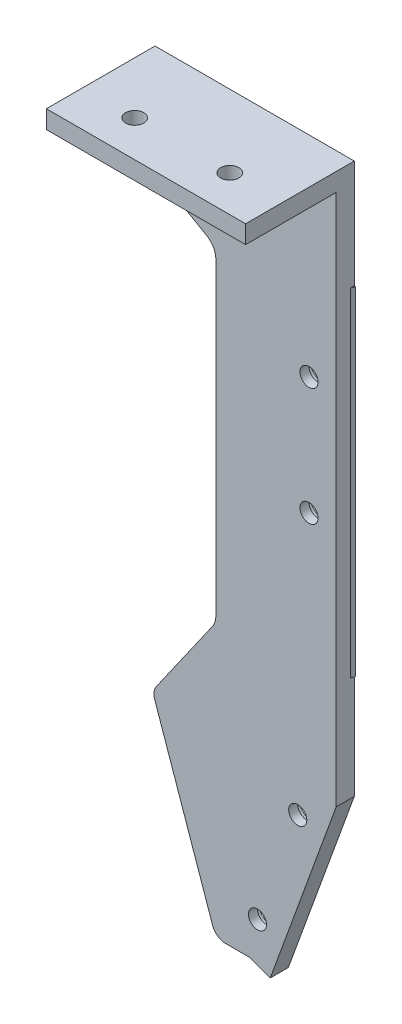
ISO-10303-21;
HEADER;
FILE_DESCRIPTION(('STEP AP214'),'2;1');
FILE_NAME('part.step','',(''),(''),'','','');
FILE_SCHEMA(('AUTOMOTIVE_DESIGN { 1 0 10303 214 1 1 1 1 }'));
ENDSEC;
DATA;
#1=APPLICATION_CONTEXT('core data for automotive mechanical design processes');
#2=APPLICATION_PROTOCOL_DEFINITION('international standard','automotive_design',2000,#1);
#3=PRODUCT_CONTEXT('',#1,'mechanical');
#4=PRODUCT('Part','Part','',(#3));
#5=PRODUCT_RELATED_PRODUCT_CATEGORY('part','',(#4));
#6=PRODUCT_DEFINITION_FORMATION('','',#4);
#7=PRODUCT_DEFINITION_CONTEXT('part definition',#1,'design');
#8=PRODUCT_DEFINITION('design','',#6,#7);
#9=PRODUCT_DEFINITION_SHAPE('','',#8);
#10=(LENGTH_UNIT() NAMED_UNIT(*) SI_UNIT(.MILLI.,.METRE.));
#11=(NAMED_UNIT(*) PLANE_ANGLE_UNIT() SI_UNIT($,.RADIAN.));
#12=(NAMED_UNIT(*) SI_UNIT($,.STERADIAN.) SOLID_ANGLE_UNIT());
#13=UNCERTAINTY_MEASURE_WITH_UNIT(LENGTH_MEASURE(1.E-05),#10,'distance_accuracy_value','');
#14=(GEOMETRIC_REPRESENTATION_CONTEXT(3) GLOBAL_UNCERTAINTY_ASSIGNED_CONTEXT((#13)) GLOBAL_UNIT_ASSIGNED_CONTEXT((#10,
#11,#12)) REPRESENTATION_CONTEXT('',''));
#15=CARTESIAN_POINT('',(0.,0.,0.));
#16=DIRECTION('',(0.,0.,1.));
#17=DIRECTION('',(1.,0.,0.));
#18=AXIS2_PLACEMENT_3D('',#15,#16,#17);
#19=CARTESIAN_POINT('',(92.2895532458189,-51.5135083268963,13.5));
#20=DIRECTION('',(0.,0.,1.));
#21=DIRECTION('',(1.,0.,0.));
#22=AXIS2_PLACEMENT_3D('',#19,#20,#21);
#23=CYLINDRICAL_SURFACE('',#22,0.999999999999998);
#24=CARTESIAN_POINT('',(92.2895532458189,-51.5135083268963,23.5));
#25=DIRECTION('',(0.,0.,1.));
#26=DIRECTION('',(1.,0.,0.));
#27=AXIS2_PLACEMENT_3D('',#24,#25,#26);
#28=CIRCLE('',#27,0.999999999999998);
#29=CARTESIAN_POINT('',(93.2895532458189,-51.5135083268963,23.5));
#30=VERTEX_POINT('',#29);
#31=EDGE_CURVE('E360',#30,#30,#28,.T.);
#32=ORIENTED_EDGE('',*,*,#31,.T.);
#33=EDGE_LOOP('',(#32));
#34=FACE_BOUND('',#33,.T.);
#35=CARTESIAN_POINT('',(92.2895532458189,-51.5135083268963,22.5));
#36=DIRECTION('',(0.,0.,-1.));
#37=DIRECTION('',(-1.,0.,0.));
#38=AXIS2_PLACEMENT_3D('',#35,#36,#37);
#39=CIRCLE('',#38,0.999999999999998);
#40=CARTESIAN_POINT('',(91.2895532458189,-51.5135083268963,22.5));
#41=VERTEX_POINT('',#40);
#42=EDGE_CURVE('E40',#41,#41,#39,.F.);
#43=ORIENTED_EDGE('',*,*,#42,.F.);
#44=EDGE_LOOP('',(#43));
#45=FACE_BOUND('',#44,.T.);
#46=ADVANCED_FACE('F36',(#34,#45),#23,.F.);
#47=CARTESIAN_POINT('',(91.0464555518717,-94.0197311334143,13.5));
#48=DIRECTION('',(0.,0.,1.));
#49=DIRECTION('',(1.,0.,0.));
#50=AXIS2_PLACEMENT_3D('',#47,#48,#49);
#51=CYLINDRICAL_SURFACE('',#50,0.999999999999998);
#52=CARTESIAN_POINT('',(91.0464555518717,-94.0197311334143,23.5));
#53=DIRECTION('',(0.,0.,1.));
#54=DIRECTION('',(1.,0.,0.));
#55=AXIS2_PLACEMENT_3D('',#52,#53,#54);
#56=CIRCLE('',#55,0.999999999999998);
#57=CARTESIAN_POINT('',(92.0464555518717,-94.0197311334143,23.5));
#58=VERTEX_POINT('',#57);
#59=EDGE_CURVE('E336',#58,#58,#56,.T.);
#60=ORIENTED_EDGE('',*,*,#59,.T.);
#61=EDGE_LOOP('',(#60));
#62=FACE_BOUND('',#61,.T.);
#63=CARTESIAN_POINT('',(91.0464555518717,-94.0197311334143,22.5));
#64=DIRECTION('',(0.,0.,-1.));
#65=DIRECTION('',(-1.,0.,0.));
#66=AXIS2_PLACEMENT_3D('',#63,#64,#65);
#67=CIRCLE('',#66,0.999999999999998);
#68=CARTESIAN_POINT('',(90.0464555518717,-94.0197311334143,22.5));
#69=VERTEX_POINT('',#68);
#70=EDGE_CURVE('E340',#69,#69,#67,.F.);
#71=ORIENTED_EDGE('',*,*,#70,.F.);
#72=EDGE_LOOP('',(#71));
#73=FACE_BOUND('',#72,.T.);
#74=ADVANCED_FACE('F460',(#62,#73),#51,.F.);
#75=CARTESIAN_POINT('',(92.2895532458189,-64.5135083268963,13.5));
#76=DIRECTION('',(0.,0.,1.));
#77=DIRECTION('',(1.,0.,0.));
#78=AXIS2_PLACEMENT_3D('',#75,#76,#77);
#79=CYLINDRICAL_SURFACE('',#78,0.999999999999998);
#80=CARTESIAN_POINT('',(92.2895532458189,-64.5135083268963,23.5));
#81=DIRECTION('',(0.,0.,1.));
#82=DIRECTION('',(1.,0.,0.));
#83=AXIS2_PLACEMENT_3D('',#80,#81,#82);
#84=CIRCLE('',#83,0.999999999999998);
#85=CARTESIAN_POINT('',(93.2895532458189,-64.5135083268963,23.5));
#86=VERTEX_POINT('',#85);
#87=EDGE_CURVE('E357',#86,#86,#84,.T.);
#88=ORIENTED_EDGE('',*,*,#87,.T.);
#89=EDGE_LOOP('',(#88));
#90=FACE_BOUND('',#89,.T.);
#91=CARTESIAN_POINT('',(92.2895532458189,-64.5135083268963,22.5));
#92=DIRECTION('',(0.,0.,-1.));
#93=DIRECTION('',(-1.,0.,0.));
#94=AXIS2_PLACEMENT_3D('',#91,#92,#93);
#95=CIRCLE('',#94,0.999999999999998);
#96=CARTESIAN_POINT('',(91.2895532458189,-64.5135083268963,22.5));
#97=VERTEX_POINT('',#96);
#98=EDGE_CURVE('E338',#97,#97,#95,.F.);
#99=ORIENTED_EDGE('',*,*,#98,.F.);
#100=EDGE_LOOP('',(#99));
#101=FACE_BOUND('',#100,.T.);
#102=ADVANCED_FACE('F466',(#90,#101),#79,.F.);
#103=CARTESIAN_POINT('',(86.6001936886376,-106.235735203631,13.5));
#104=DIRECTION('',(0.,0.,1.));
#105=DIRECTION('',(1.,0.,0.));
#106=AXIS2_PLACEMENT_3D('',#103,#104,#105);
#107=CYLINDRICAL_SURFACE('',#106,0.999999999999998);
#108=CARTESIAN_POINT('',(86.6001936886376,-106.235735203631,23.5));
#109=DIRECTION('',(0.,0.,1.));
#110=DIRECTION('',(1.,0.,0.));
#111=AXIS2_PLACEMENT_3D('',#108,#109,#110);
#112=CIRCLE('',#111,0.999999999999998);
#113=CARTESIAN_POINT('',(87.6001936886376,-106.235735203631,23.5));
#114=VERTEX_POINT('',#113);
#115=EDGE_CURVE('E361',#114,#114,#112,.T.);
#116=ORIENTED_EDGE('',*,*,#115,.T.);
#117=EDGE_LOOP('',(#116));
#118=FACE_BOUND('',#117,.T.);
#119=CARTESIAN_POINT('',(86.6001936886376,-106.235735203631,22.5));
#120=DIRECTION('',(0.,0.,-1.));
#121=DIRECTION('',(-1.,0.,0.));
#122=AXIS2_PLACEMENT_3D('',#119,#120,#121);
#123=CIRCLE('',#122,0.999999999999998);
#124=CARTESIAN_POINT('',(85.6001936886376,-106.235735203631,22.5));
#125=VERTEX_POINT('',#124);
#126=EDGE_CURVE('E333',#125,#125,#123,.F.);
#127=ORIENTED_EDGE('',*,*,#126,.F.);
#128=EDGE_LOOP('',(#127));
#129=FACE_BOUND('',#128,.T.);
#130=ADVANCED_FACE('F490',(#118,#129),#107,.F.);
#131=CARTESIAN_POINT('',(0.,0.,23.5));
#132=DIRECTION('',(0.,0.,-1.));
#133=DIRECTION('',(-1.,0.,0.));
#134=AXIS2_PLACEMENT_3D('',#131,#132,#133);
#135=PLANE('',#134);
#136=ORIENTED_EDGE('',*,*,#87,.F.);
#137=EDGE_LOOP('',(#136));
#138=FACE_BOUND('',#137,.T.);
#139=ORIENTED_EDGE('',*,*,#115,.F.);
#140=EDGE_LOOP('',(#139));
#141=FACE_BOUND('',#140,.T.);
#142=ORIENTED_EDGE('',*,*,#59,.F.);
#143=EDGE_LOOP('',(#142));
#144=FACE_BOUND('',#143,.T.);
#145=ORIENTED_EDGE('',*,*,#31,.F.);
#146=EDGE_LOOP('',(#145));
#147=FACE_BOUND('',#146,.T.);
#148=DIRECTION('',(1.,0.,0.));
#149=VECTOR('',#148,1.);
#150=CARTESIAN_POINT('',(95.2895532458189,-32.3635083268963,23.5));
#151=LINE('',#150,#149);
#152=CARTESIAN_POINT('',(73.2895532458189,-32.3635083268963,23.5));
#153=VERTEX_POINT('',#152);
#154=CARTESIAN_POINT('',(95.2895532458189,-32.3635083268963,23.5));
#155=VERTEX_POINT('',#154);
#156=EDGE_CURVE('E53',#153,#155,#151,.T.);
#157=ORIENTED_EDGE('',*,*,#156,.F.);
#158=DIRECTION('',(0.,-1.,0.));
#159=VECTOR('',#158,1.);
#160=CARTESIAN_POINT('',(73.2895532458189,0.,23.5));
#161=LINE('',#160,#159);
#162=CARTESIAN_POINT('',(73.2895532458189,-38.0445239136101,23.5));
#163=VERTEX_POINT('',#162);
#164=EDGE_CURVE('E56',#153,#163,#161,.T.);
#165=ORIENTED_EDGE('',*,*,#164,.T.);
#166=CARTESIAN_POINT('',(75.2895532458189,-38.0445239136101,23.5));
#167=DIRECTION('',(0.,0.,-1.));
#168=DIRECTION('',(-1.,0.,0.));
#169=AXIS2_PLACEMENT_3D('',#166,#167,#168);
#170=CIRCLE('',#169,2.);
#171=CARTESIAN_POINT('',(74.2895532458182,-39.7765747211803,23.5));
#172=VERTEX_POINT('',#171);
#173=EDGE_CURVE('E11',#163,#172,#170,.F.);
#174=ORIENTED_EDGE('',*,*,#173,.T.);
#175=DIRECTION('',(-0.866025403784429,0.500000000000017,0.));
#176=VECTOR('',#175,1.);
#177=CARTESIAN_POINT('',(1.34862621941938,2.3358891324538,23.5));
#178=LINE('',#177,#176);
#179=CARTESIAN_POINT('',(81.,-43.65085296109,23.5));
#180=VERTEX_POINT('',#179);
#181=EDGE_CURVE('E236',#180,#172,#178,.T.);
#182=ORIENTED_EDGE('',*,*,#181,.F.);
#183=CARTESIAN_POINT('',(80.,-45.38290376865,23.5));
#184=DIRECTION('',(0.,0.,-1.));
#185=DIRECTION('',(-1.,0.,0.));
#186=AXIS2_PLACEMENT_3D('',#183,#184,#185);
#187=CIRCLE('',#186,2.);
#188=CARTESIAN_POINT('',(82.,-45.38290376865,23.5));
#189=VERTEX_POINT('',#188);
#190=EDGE_CURVE('E233',#189,#180,#187,.F.);
#191=ORIENTED_EDGE('',*,*,#190,.F.);
#192=DIRECTION('',(0.,1.,0.));
#193=VECTOR('',#192,1.);
#194=CARTESIAN_POINT('',(82.,0.,23.5));
#195=LINE('',#194,#193);
#196=CARTESIAN_POINT('',(82.,-79.5316263413399,23.5));
#197=VERTEX_POINT('',#196);
#198=EDGE_CURVE('E230',#197,#189,#195,.T.);
#199=ORIENTED_EDGE('',*,*,#198,.F.);
#200=CARTESIAN_POINT('',(80.,-79.5316263413399,23.5));
#201=DIRECTION('',(0.,0.,-1.));
#202=DIRECTION('',(-1.,0.,0.));
#203=AXIS2_PLACEMENT_3D('',#200,#201,#202);
#204=CIRCLE('',#203,2.);
#205=CARTESIAN_POINT('',(81.6383040885789,-80.6787792140407,23.5));
#206=VERTEX_POINT('',#205);
#207=EDGE_CURVE('E227',#206,#197,#204,.F.);
#208=ORIENTED_EDGE('',*,*,#207,.F.);
#209=DIRECTION('',(0.573576436351011,0.819152044289016,0.));
#210=VECTOR('',#209,1.);
#211=CARTESIAN_POINT('',(92.6867510176329,-64.8999617547072,23.5));
#212=LINE('',#211,#210);
#213=CARTESIAN_POINT('',(75.439940364479,-89.5309600116699,23.5));
#214=VERTEX_POINT('',#213);
#215=EDGE_CURVE('E224',#214,#206,#212,.T.);
#216=ORIENTED_EDGE('',*,*,#215,.F.);
#217=CARTESIAN_POINT('',(76.668668430912,-90.3913246662,23.5));
#218=DIRECTION('',(0.,0.,-1.));
#219=DIRECTION('',(-1.,0.,0.));
#220=AXIS2_PLACEMENT_3D('',#217,#218,#219);
#221=CIRCLE('',#220,1.5);
#222=CARTESIAN_POINT('',(75.2518037731161,-90.8837620139803,23.5));
#223=VERTEX_POINT('',#222);
#224=EDGE_CURVE('E221',#223,#214,#221,.T.);
#225=ORIENTED_EDGE('',*,*,#224,.F.);
#226=DIRECTION('',(-0.328291565188003,0.944576438530208,0.));
#227=VECTOR('',#226,1.);
#228=CARTESIAN_POINT('',(38.9587796924058,13.5402898498463,23.5));
#229=LINE('',#228,#227);
#230=CARTESIAN_POINT('',(81.6498173079181,-109.29243734778,23.5));
#231=VERTEX_POINT('',#230);
#232=EDGE_CURVE('E218',#231,#223,#229,.T.);
#233=ORIENTED_EDGE('',*,*,#232,.F.);
#234=CARTESIAN_POINT('',(83.066681965713,-108.8,23.5));
#235=DIRECTION('',(0.,0.,-1.));
#236=DIRECTION('',(-1.,0.,0.));
#237=AXIS2_PLACEMENT_3D('',#234,#235,#236);
#238=CIRCLE('',#237,1.5);
#239=CARTESIAN_POINT('',(83.066681965713,-110.3,23.5));
#240=VERTEX_POINT('',#239);
#241=EDGE_CURVE('E215',#240,#231,#238,.T.);
#242=ORIENTED_EDGE('',*,*,#241,.F.);
#243=DIRECTION('',(-1.,0.,0.));
#244=VECTOR('',#243,1.);
#245=CARTESIAN_POINT('',(-1.77186336060973E-12,-110.299999999999,23.5));
#246=LINE('',#245,#244);
#247=CARTESIAN_POINT('',(85.720595314676,-110.3,23.5));
#248=VERTEX_POINT('',#247);
#249=EDGE_CURVE('E212',#248,#240,#246,.T.);
#250=ORIENTED_EDGE('',*,*,#249,.F.);
#251=DIRECTION('',(-0.939692620785897,0.342020143325699,0.));
#252=VECTOR('',#251,1.);
#253=CARTESIAN_POINT('',(-25.4223318677038,-69.8472827563908,23.5));
#254=LINE('',#253,#252);
#255=CARTESIAN_POINT('',(88.0101485604946,-111.133329231243,23.5));
#256=VERTEX_POINT('',#255);
#257=EDGE_CURVE('E209',#256,#248,#254,.T.);
#258=ORIENTED_EDGE('',*,*,#257,.F.);
#259=DIRECTION('',(-0.342020143325699,-0.939692620785897,0.));
#260=VECTOR('',#259,1.);
#261=CARTESIAN_POINT('',(113.432480428198,-41.2860464748519,23.5));
#262=LINE('',#261,#260);
#263=CARTESIAN_POINT('',(95.2895532458189,-91.1333292312439,23.5));
#264=VERTEX_POINT('',#263);
#265=EDGE_CURVE('E205',#264,#256,#262,.T.);
#266=ORIENTED_EDGE('',*,*,#265,.F.);
#267=DIRECTION('',(0.,1.,0.));
#268=VECTOR('',#267,1.);
#269=CARTESIAN_POINT('',(95.2895532458189,0.,23.5));
#270=LINE('',#269,#268);
#271=EDGE_CURVE('E203',#264,#155,#270,.T.);
#272=ORIENTED_EDGE('',*,*,#271,.T.);
#273=EDGE_LOOP('',(#157,#165,#174,#182,#191,#199,#208,#216,#225,#233,#242,#250,#258,#266,#272));
#274=FACE_BOUND('',#273,.T.);
#275=ADVANCED_FACE('F401',(#138,#141,#144,#147,#274),#135,.F.);
#276=CARTESIAN_POINT('',(93.5,-42.3,21.));
#277=DIRECTION('',(0.,-1.,0.));
#278=DIRECTION('',(-1.,0.,0.));
#279=AXIS2_PLACEMENT_3D('',#276,#277,#278);
#280=CYLINDRICAL_SURFACE('',#279,2.);
#281=CARTESIAN_POINT('',(93.5,-42.3,21.));
#282=DIRECTION('',(0.,-1.,0.));
#283=DIRECTION('',(1.,0.,0.));
#284=AXIS2_PLACEMENT_3D('',#281,#282,#283);
#285=CIRCLE('',#284,2.);
#286=CARTESIAN_POINT('',(95.4364916731037,-42.3,21.5));
#287=VERTEX_POINT('',#286);
#288=CARTESIAN_POINT('',(95.2895532458189,-42.3,21.8930280960748));
#289=VERTEX_POINT('',#288);
#290=EDGE_CURVE('E321',#287,#289,#285,.T.);
#291=ORIENTED_EDGE('',*,*,#290,.T.);
#292=DIRECTION('',(0.,-1.,0.));
#293=VECTOR('',#292,1.);
#294=CARTESIAN_POINT('',(95.2895532458189,-42.3,21.8930280960748));
#295=LINE('',#294,#293);
#296=CARTESIAN_POINT('',(95.2895532458189,-79.5997924618132,21.8930280960748));
#297=VERTEX_POINT('',#296);
#298=EDGE_CURVE('E251',#289,#297,#295,.T.);
#299=ORIENTED_EDGE('',*,*,#298,.T.);
#300=CARTESIAN_POINT('',(93.5,-79.59979246179,21.));
#301=DIRECTION('',(0.,-1.,0.));
#302=DIRECTION('',(1.,0.,0.));
#303=AXIS2_PLACEMENT_3D('',#300,#301,#302);
#304=CIRCLE('',#303,2.);
#305=CARTESIAN_POINT('',(95.4364916731037,-79.5997924618132,21.5));
#306=VERTEX_POINT('',#305);
#307=EDGE_CURVE('E272',#306,#297,#304,.T.);
#308=ORIENTED_EDGE('',*,*,#307,.F.);
#309=DIRECTION('',(0.,-1.,0.));
#310=VECTOR('',#309,1.);
#311=CARTESIAN_POINT('',(95.4364916731037,-42.3,21.5));
#312=LINE('',#311,#310);
#313=EDGE_CURVE('E263',#287,#306,#312,.T.);
#314=ORIENTED_EDGE('',*,*,#313,.F.);
#315=EDGE_LOOP('',(#291,#299,#308,#314));
#316=FACE_BOUND('',#315,.T.);
#317=ADVANCED_FACE('F446',(#316),#280,.T.);
#318=CARTESIAN_POINT('',(94.38388347648,-79.59979246179,21.88388347648));
#319=DIRECTION('',(0.,1.,0.));
#320=DIRECTION('',(0.,0.,-1.));
#321=AXIS2_PLACEMENT_3D('',#318,#319,#320);
#322=PLANE('',#321);
#323=DIRECTION('',(0.,0.,1.));
#324=VECTOR('',#323,1.);
#325=CARTESIAN_POINT('',(95.2895532458189,-79.59979246179,21.88388347648));
#326=LINE('',#325,#324);
#327=CARTESIAN_POINT('',(95.2895532458189,-79.5997924618016,21.5));
#328=VERTEX_POINT('',#327);
#329=EDGE_CURVE('E254',#328,#297,#326,.T.);
#330=ORIENTED_EDGE('',*,*,#329,.F.);
#331=DIRECTION('',(1.,0.,0.));
#332=VECTOR('',#331,1.);
#333=CARTESIAN_POINT('',(94.38388347648,-79.59979246179,21.5));
#334=LINE('',#333,#332);
#335=EDGE_CURVE('E266',#328,#306,#334,.T.);
#336=ORIENTED_EDGE('',*,*,#335,.T.);
#337=ORIENTED_EDGE('',*,*,#307,.T.);
#338=EDGE_LOOP('',(#330,#336,#337));
#339=FACE_BOUND('',#338,.T.);
#340=ADVANCED_FACE('F440',(#339),#322,.F.);
#341=CARTESIAN_POINT('',(94.75,-42.3,18.));
#342=DIRECTION('',(0.,1.,0.));
#343=DIRECTION('',(0.,0.,-1.));
#344=AXIS2_PLACEMENT_3D('',#341,#342,#343);
#345=PLANE('',#344);
#346=DIRECTION('',(1.,0.,0.));
#347=VECTOR('',#346,1.);
#348=CARTESIAN_POINT('',(94.75,-42.3,21.5));
#349=LINE('',#348,#347);
#350=CARTESIAN_POINT('',(95.2895532458189,-42.3,21.5));
#351=VERTEX_POINT('',#350);
#352=EDGE_CURVE('E261',#351,#287,#349,.T.);
#353=ORIENTED_EDGE('',*,*,#352,.F.);
#354=DIRECTION('',(0.,0.,1.));
#355=VECTOR('',#354,1.);
#356=CARTESIAN_POINT('',(95.2895532458189,-42.3,18.));
#357=LINE('',#356,#355);
#358=EDGE_CURVE('E244',#351,#289,#357,.T.);
#359=ORIENTED_EDGE('',*,*,#358,.T.);
#360=ORIENTED_EDGE('',*,*,#290,.F.);
#361=EDGE_LOOP('',(#353,#359,#360));
#362=FACE_BOUND('',#361,.T.);
#363=ADVANCED_FACE('F448',(#362),#345,.T.);
#364=CARTESIAN_POINT('',(70.,-110.3,21.5));
#365=DIRECTION('',(0.,0.,1.));
#366=DIRECTION('',(0.,-1.,0.));
#367=AXIS2_PLACEMENT_3D('',#364,#365,#366);
#368=PLANE('',#367);
#369=CARTESIAN_POINT('',(91.0464555518717,-94.0197311334143,21.5));
#370=DIRECTION('',(0.,0.,-1.));
#371=DIRECTION('',(-1.,0.,0.));
#372=AXIS2_PLACEMENT_3D('',#369,#370,#371);
#373=CIRCLE('',#372,2.);
#374=CARTESIAN_POINT('',(89.0464555518717,-94.0197311334143,21.5));
#375=VERTEX_POINT('',#374);
#376=EDGE_CURVE('E799',#375,#375,#373,.T.);
#377=ORIENTED_EDGE('',*,*,#376,.F.);
#378=EDGE_LOOP('',(#377));
#379=FACE_BOUND('',#378,.T.);
#380=CARTESIAN_POINT('',(92.2895532458189,-64.5135083268963,21.5));
#381=DIRECTION('',(0.,0.,-1.));
#382=DIRECTION('',(-1.,0.,0.));
#383=AXIS2_PLACEMENT_3D('',#380,#381,#382);
#384=CIRCLE('',#383,2.);
#385=CARTESIAN_POINT('',(90.2895532458189,-64.5135083268963,21.5));
#386=VERTEX_POINT('',#385);
#387=EDGE_CURVE('E791',#386,#386,#384,.T.);
#388=ORIENTED_EDGE('',*,*,#387,.F.);
#389=EDGE_LOOP('',(#388));
#390=FACE_BOUND('',#389,.T.);
#391=CARTESIAN_POINT('',(92.2895532458189,-51.5135083268963,21.5));
#392=DIRECTION('',(0.,0.,-1.));
#393=DIRECTION('',(-1.,0.,0.));
#394=AXIS2_PLACEMENT_3D('',#391,#392,#393);
#395=CIRCLE('',#394,2.);
#396=CARTESIAN_POINT('',(90.2895532458189,-51.5135083268963,21.5));
#397=VERTEX_POINT('',#396);
#398=EDGE_CURVE('E789',#397,#397,#395,.T.);
#399=ORIENTED_EDGE('',*,*,#398,.F.);
#400=EDGE_LOOP('',(#399));
#401=FACE_BOUND('',#400,.T.);
#402=CARTESIAN_POINT('',(86.6001936886376,-106.235735203631,21.5));
#403=DIRECTION('',(0.,0.,-1.));
#404=DIRECTION('',(-1.,0.,0.));
#405=AXIS2_PLACEMENT_3D('',#402,#403,#404);
#406=CIRCLE('',#405,2.);
#407=CARTESIAN_POINT('',(84.6001936886376,-106.235735203631,21.5));
#408=VERTEX_POINT('',#407);
#409=EDGE_CURVE('E346',#408,#408,#406,.T.);
#410=ORIENTED_EDGE('',*,*,#409,.F.);
#411=EDGE_LOOP('',(#410));
#412=FACE_BOUND('',#411,.T.);
#413=DIRECTION('',(-0.866025403784429,0.500000000000017,0.));
#414=VECTOR('',#413,1.);
#415=CARTESIAN_POINT('',(81.,-43.65085296109,21.5));
#416=LINE('',#415,#414);
#417=CARTESIAN_POINT('',(81.,-43.65085296109,21.5));
#418=VERTEX_POINT('',#417);
#419=CARTESIAN_POINT('',(74.2895532458181,-39.7765747211803,21.5));
#420=VERTEX_POINT('',#419);
#421=EDGE_CURVE('E297',#418,#420,#416,.T.);
#422=ORIENTED_EDGE('',*,*,#421,.T.);
#423=CARTESIAN_POINT('',(75.2895532458189,-38.0445239136101,21.5));
#424=DIRECTION('',(0.,0.,1.));
#425=DIRECTION('',(1.,0.,0.));
#426=AXIS2_PLACEMENT_3D('',#423,#424,#425);
#427=CIRCLE('',#426,2.);
#428=CARTESIAN_POINT('',(73.2895532458189,-38.0445239136101,21.5));
#429=VERTEX_POINT('',#428);
#430=EDGE_CURVE('E330',#420,#429,#427,.F.);
#431=ORIENTED_EDGE('',*,*,#430,.T.);
#432=DIRECTION('',(0.,-1.,0.));
#433=VECTOR('',#432,1.);
#434=CARTESIAN_POINT('',(73.2895532458189,0.,21.5));
#435=LINE('',#434,#433);
#436=CARTESIAN_POINT('',(73.2895532458189,-30.3635083268963,21.5));
#437=VERTEX_POINT('',#436);
#438=EDGE_CURVE('E194',#437,#429,#435,.T.);
#439=ORIENTED_EDGE('',*,*,#438,.F.);
#440=DIRECTION('',(-1.,0.,0.));
#441=VECTOR('',#440,1.);
#442=CARTESIAN_POINT('',(70.,-30.3635083268963,21.5));
#443=LINE('',#442,#441);
#444=CARTESIAN_POINT('',(95.2895532458189,-30.3635083268963,21.5));
#445=VERTEX_POINT('',#444);
#446=EDGE_CURVE('E259',#437,#445,#443,.F.);
#447=ORIENTED_EDGE('',*,*,#446,.T.);
#448=DIRECTION('',(0.,1.,0.));
#449=VECTOR('',#448,1.);
#450=CARTESIAN_POINT('',(95.2895532458189,0.,21.5));
#451=LINE('',#450,#449);
#452=EDGE_CURVE('E202',#351,#445,#451,.T.);
#453=ORIENTED_EDGE('',*,*,#452,.F.);
#454=ORIENTED_EDGE('',*,*,#352,.T.);
#455=ORIENTED_EDGE('',*,*,#313,.T.);
#456=ORIENTED_EDGE('',*,*,#335,.F.);
#457=CARTESIAN_POINT('',(95.2895532458189,-91.1333292312439,21.5));
#458=VERTEX_POINT('',#457);
#459=EDGE_CURVE('E206',#458,#328,#451,.T.);
#460=ORIENTED_EDGE('',*,*,#459,.F.);
#461=DIRECTION('',(-0.342020143325699,-0.939692620785897,0.));
#462=VECTOR('',#461,1.);
#463=CARTESIAN_POINT('',(95.2895532458189,-91.1333292312439,21.5));
#464=LINE('',#463,#462);
#465=CARTESIAN_POINT('',(88.0101485604946,-111.133329231243,21.5));
#466=VERTEX_POINT('',#465);
#467=EDGE_CURVE('E256',#458,#466,#464,.T.);
#468=ORIENTED_EDGE('',*,*,#467,.T.);
#469=DIRECTION('',(-0.939692620785897,0.342020143325699,0.));
#470=VECTOR('',#469,1.);
#471=CARTESIAN_POINT('',(86.190441625069,-110.47101007166,21.5));
#472=LINE('',#471,#470);
#473=CARTESIAN_POINT('',(85.720595314676,-110.3,21.5));
#474=VERTEX_POINT('',#473);
#475=EDGE_CURVE('E269',#466,#474,#472,.T.);
#476=ORIENTED_EDGE('',*,*,#475,.T.);
#477=DIRECTION('',(1.,0.,0.));
#478=VECTOR('',#477,1.);
#479=CARTESIAN_POINT('',(83.066681965713,-110.3,21.5));
#480=LINE('',#479,#478);
#481=CARTESIAN_POINT('',(83.066681965713,-110.3,21.5));
#482=VERTEX_POINT('',#481);
#483=EDGE_CURVE('E274',#482,#474,#480,.T.);
#484=ORIENTED_EDGE('',*,*,#483,.F.);
#485=CARTESIAN_POINT('',(83.066681965713,-108.8,21.5));
#486=DIRECTION('',(0.,0.,-1.));
#487=DIRECTION('',(0.,-1.,0.));
#488=AXIS2_PLACEMENT_3D('',#485,#486,#487);
#489=CIRCLE('',#488,1.5);
#490=CARTESIAN_POINT('',(81.6498173079181,-109.29243734778,21.5));
#491=VERTEX_POINT('',#490);
#492=EDGE_CURVE('E273',#482,#491,#489,.T.);
#493=ORIENTED_EDGE('',*,*,#492,.T.);
#494=DIRECTION('',(-0.328291565188003,0.944576438530208,0.));
#495=VECTOR('',#494,1.);
#496=CARTESIAN_POINT('',(81.6498173079181,-109.29243734778,21.5));
#497=LINE('',#496,#495);
#498=CARTESIAN_POINT('',(75.251803773117,-90.88376201398,21.5));
#499=VERTEX_POINT('',#498);
#500=EDGE_CURVE('E279',#491,#499,#497,.T.);
#501=ORIENTED_EDGE('',*,*,#500,.T.);
#502=CARTESIAN_POINT('',(76.668668430912,-90.3913246662,21.5));
#503=DIRECTION('',(0.,0.,-1.));
#504=DIRECTION('',(-0.944576438530206,-0.328291565188007,0.));
#505=AXIS2_PLACEMENT_3D('',#502,#503,#504);
#506=CIRCLE('',#505,1.5);
#507=CARTESIAN_POINT('',(75.439940364479,-89.5309600116699,21.5));
#508=VERTEX_POINT('',#507);
#509=EDGE_CURVE('E282',#499,#508,#506,.T.);
#510=ORIENTED_EDGE('',*,*,#509,.T.);
#511=DIRECTION('',(0.573576436351011,0.819152044289016,0.));
#512=VECTOR('',#511,1.);
#513=CARTESIAN_POINT('',(75.439940364479,-89.5309600116699,21.5));
#514=LINE('',#513,#512);
#515=CARTESIAN_POINT('',(81.638304088578,-80.67877921404,21.5));
#516=VERTEX_POINT('',#515);
#517=EDGE_CURVE('E285',#508,#516,#514,.T.);
#518=ORIENTED_EDGE('',*,*,#517,.T.);
#519=CARTESIAN_POINT('',(80.,-79.5316263413399,21.5));
#520=DIRECTION('',(0.,0.,1.));
#521=DIRECTION('',(0.81915204428897,-0.573576436351077,0.));
#522=AXIS2_PLACEMENT_3D('',#519,#520,#521);
#523=CIRCLE('',#522,2.);
#524=CARTESIAN_POINT('',(82.,-79.5316263413399,21.5));
#525=VERTEX_POINT('',#524);
#526=EDGE_CURVE('E288',#516,#525,#523,.T.);
#527=ORIENTED_EDGE('',*,*,#526,.T.);
#528=DIRECTION('',(0.,1.,0.));
#529=VECTOR('',#528,1.);
#530=CARTESIAN_POINT('',(82.,-79.5316263413399,21.5));
#531=LINE('',#530,#529);
#532=CARTESIAN_POINT('',(82.,-45.38290376865,21.5));
#533=VERTEX_POINT('',#532);
#534=EDGE_CURVE('E291',#525,#533,#531,.T.);
#535=ORIENTED_EDGE('',*,*,#534,.T.);
#536=CARTESIAN_POINT('',(80.,-45.38290376865,21.5));
#537=DIRECTION('',(0.,0.,1.));
#538=DIRECTION('',(1.,0.,0.));
#539=AXIS2_PLACEMENT_3D('',#536,#537,#538);
#540=CIRCLE('',#539,2.);
#541=EDGE_CURVE('E294',#533,#418,#540,.T.);
#542=ORIENTED_EDGE('',*,*,#541,.T.);
#543=EDGE_LOOP('',(#422,#431,#439,#447,#453,#454,#455,#456,#460,#468,#476,#484,#493,#501,#510,
#518,#527,#535,#542));
#544=FACE_BOUND('',#543,.T.);
#545=ADVANCED_FACE('F392',(#379,#390,#401,#412,#544),#368,.F.);
#546=CARTESIAN_POINT('',(76.,-40.76410161514,22.25));
#547=DIRECTION('',(0.500000000000017,0.866025403784429,0.));
#548=DIRECTION('',(0.866025403784429,-0.500000000000017,0.));
#549=AXIS2_PLACEMENT_3D('',#546,#547,#548);
#550=PLANE('',#549);
#551=ORIENTED_EDGE('',*,*,#181,.T.);
#552=DIRECTION('',(0.,0.,-1.));
#553=VECTOR('',#552,1.);
#554=CARTESIAN_POINT('',(74.2895532458189,-39.776574721179,22.25));
#555=LINE('',#554,#553);
#556=EDGE_CURVE('E327',#172,#420,#555,.T.);
#557=ORIENTED_EDGE('',*,*,#556,.T.);
#558=ORIENTED_EDGE('',*,*,#421,.F.);
#559=DIRECTION('',(0.,0.,-1.));
#560=VECTOR('',#559,1.);
#561=CARTESIAN_POINT('',(81.,-43.65085296109,23.));
#562=LINE('',#561,#560);
#563=EDGE_CURVE('E300',#180,#418,#562,.T.);
#564=ORIENTED_EDGE('',*,*,#563,.F.);
#565=EDGE_LOOP('',(#551,#557,#558,#564));
#566=FACE_BOUND('',#565,.T.);
#567=ADVANCED_FACE('F398',(#566),#550,.F.);
#568=CARTESIAN_POINT('',(80.,-45.38290376865,69.9296));
#569=DIRECTION('',(0.,0.,-1.));
#570=DIRECTION('',(-0.500000000000015,-0.86602540378443,0.));
#571=AXIS2_PLACEMENT_3D('',#568,#569,#570);
#572=CYLINDRICAL_SURFACE('',#571,2.);
#573=ORIENTED_EDGE('',*,*,#541,.F.);
#574=DIRECTION('',(0.,0.,-1.));
#575=VECTOR('',#574,1.);
#576=CARTESIAN_POINT('',(82.,-45.38290376865,23.));
#577=LINE('',#576,#575);
#578=EDGE_CURVE('E303',#189,#533,#577,.T.);
#579=ORIENTED_EDGE('',*,*,#578,.F.);
#580=ORIENTED_EDGE('',*,*,#190,.T.);
#581=ORIENTED_EDGE('',*,*,#563,.T.);
#582=EDGE_LOOP('',(#573,#579,#580,#581));
#583=FACE_BOUND('',#582,.T.);
#584=ADVANCED_FACE('F404',(#583),#572,.F.);
#585=CARTESIAN_POINT('',(82.,-62.19521357469,22.25));
#586=DIRECTION('',(1.,0.,0.));
#587=DIRECTION('',(0.,-1.,0.));
#588=AXIS2_PLACEMENT_3D('',#585,#586,#587);
#589=PLANE('',#588);
#590=DIRECTION('',(0.,0.,-1.));
#591=VECTOR('',#590,1.);
#592=CARTESIAN_POINT('',(82.,-79.5316263413399,23.));
#593=LINE('',#592,#591);
#594=EDGE_CURVE('E306',#197,#525,#593,.T.);
#595=ORIENTED_EDGE('',*,*,#594,.F.);
#596=ORIENTED_EDGE('',*,*,#198,.T.);
#597=ORIENTED_EDGE('',*,*,#578,.T.);
#598=ORIENTED_EDGE('',*,*,#534,.F.);
#599=EDGE_LOOP('',(#595,#596,#597,#598));
#600=FACE_BOUND('',#599,.T.);
#601=ADVANCED_FACE('F406',(#600),#589,.F.);
#602=CARTESIAN_POINT('',(80.,-79.5316263413399,69.9296));
#603=DIRECTION('',(0.,0.,-1.));
#604=DIRECTION('',(-1.,0.,0.));
#605=AXIS2_PLACEMENT_3D('',#602,#603,#604);
#606=CYLINDRICAL_SURFACE('',#605,2.);
#607=ORIENTED_EDGE('',*,*,#526,.F.);
#608=DIRECTION('',(0.,0.,-1.));
#609=VECTOR('',#608,1.);
#610=CARTESIAN_POINT('',(81.638304088578,-80.67877921404,23.));
#611=LINE('',#610,#609);
#612=EDGE_CURVE('E310',#206,#516,#611,.T.);
#613=ORIENTED_EDGE('',*,*,#612,.F.);
#614=ORIENTED_EDGE('',*,*,#207,.T.);
#615=ORIENTED_EDGE('',*,*,#594,.T.);
#616=EDGE_LOOP('',(#607,#613,#614,#615));
#617=FACE_BOUND('',#616,.T.);
#618=ADVANCED_FACE('F410',(#617),#606,.F.);
#619=CARTESIAN_POINT('',(76.,-88.7311119595499,22.25));
#620=DIRECTION('',(0.819152044289016,-0.573576436351011,0.));
#621=DIRECTION('',(-0.573576436351011,-0.819152044289016,0.));
#622=AXIS2_PLACEMENT_3D('',#619,#620,#621);
#623=PLANE('',#622);
#624=ORIENTED_EDGE('',*,*,#517,.F.);
#625=DIRECTION('',(0.,0.,1.));
#626=VECTOR('',#625,1.);
#627=CARTESIAN_POINT('',(75.439940364479,-89.5309600116699,21.5));
#628=LINE('',#627,#626);
#629=EDGE_CURVE('E309',#508,#214,#628,.T.);
#630=ORIENTED_EDGE('',*,*,#629,.T.);
#631=ORIENTED_EDGE('',*,*,#215,.T.);
#632=ORIENTED_EDGE('',*,*,#612,.T.);
#633=EDGE_LOOP('',(#624,#630,#631,#632));
#634=FACE_BOUND('',#633,.T.);
#635=ADVANCED_FACE('F412',(#634),#623,.F.);
#636=CARTESIAN_POINT('',(76.668668430912,-90.3913246662,-59.9296));
#637=DIRECTION('',(0.,0.,1.));
#638=DIRECTION('',(0.819152044289016,-0.573576436351012,0.));
#639=AXIS2_PLACEMENT_3D('',#636,#637,#638);
#640=CYLINDRICAL_SURFACE('',#639,1.5);
#641=ORIENTED_EDGE('',*,*,#629,.F.);
#642=ORIENTED_EDGE('',*,*,#509,.F.);
#643=DIRECTION('',(0.,0.,1.));
#644=VECTOR('',#643,1.);
#645=CARTESIAN_POINT('',(75.251803773117,-90.88376201398,21.5));
#646=LINE('',#645,#644);
#647=EDGE_CURVE('E313',#499,#223,#646,.T.);
#648=ORIENTED_EDGE('',*,*,#647,.T.);
#649=ORIENTED_EDGE('',*,*,#224,.T.);
#650=EDGE_LOOP('',(#641,#642,#648,#649));
#651=FACE_BOUND('',#650,.T.);
#652=ADVANCED_FACE('F417',(#651),#640,.T.);
#653=CARTESIAN_POINT('',(78.5,-100.22962998314,22.25));
#654=DIRECTION('',(0.944576438530208,0.328291565188003,0.));
#655=DIRECTION('',(0.328291565188003,-0.944576438530208,0.));
#656=AXIS2_PLACEMENT_3D('',#653,#654,#655);
#657=PLANE('',#656);
#658=ORIENTED_EDGE('',*,*,#500,.F.);
#659=DIRECTION('',(0.,0.,1.));
#660=VECTOR('',#659,1.);
#661=CARTESIAN_POINT('',(81.6498173079181,-109.29243734778,21.5));
#662=LINE('',#661,#660);
#663=EDGE_CURVE('E316',#491,#231,#662,.T.);
#664=ORIENTED_EDGE('',*,*,#663,.T.);
#665=ORIENTED_EDGE('',*,*,#232,.T.);
#666=ORIENTED_EDGE('',*,*,#647,.F.);
#667=EDGE_LOOP('',(#658,#664,#665,#666));
#668=FACE_BOUND('',#667,.T.);
#669=ADVANCED_FACE('F420',(#668),#657,.F.);
#670=CARTESIAN_POINT('',(83.066681965713,-108.8,-59.9296));
#671=DIRECTION('',(0.,0.,1.));
#672=DIRECTION('',(0.944576438530206,0.328291565188007,0.));
#673=AXIS2_PLACEMENT_3D('',#670,#671,#672);
#674=CYLINDRICAL_SURFACE('',#673,1.5);
#675=ORIENTED_EDGE('',*,*,#663,.F.);
#676=ORIENTED_EDGE('',*,*,#492,.F.);
#677=DIRECTION('',(0.,0.,1.));
#678=VECTOR('',#677,1.);
#679=CARTESIAN_POINT('',(83.066681965713,-110.3,21.5));
#680=LINE('',#679,#678);
#681=EDGE_CURVE('E276',#482,#240,#680,.T.);
#682=ORIENTED_EDGE('',*,*,#681,.T.);
#683=ORIENTED_EDGE('',*,*,#241,.T.);
#684=EDGE_LOOP('',(#675,#676,#682,#683));
#685=FACE_BOUND('',#684,.T.);
#686=ADVANCED_FACE('F425',(#685),#674,.T.);
#687=CARTESIAN_POINT('',(81.5,-110.3,22.25));
#688=DIRECTION('',(0.,-1.,0.));
#689=DIRECTION('',(-1.,0.,0.));
#690=AXIS2_PLACEMENT_3D('',#687,#688,#689);
#691=PLANE('',#690);
#692=ORIENTED_EDGE('',*,*,#483,.T.);
#693=DIRECTION('',(0.,0.,-1.));
#694=VECTOR('',#693,1.);
#695=CARTESIAN_POINT('',(85.720595314676,-110.3,23.));
#696=LINE('',#695,#694);
#697=EDGE_CURVE('E268',#248,#474,#696,.T.);
#698=ORIENTED_EDGE('',*,*,#697,.F.);
#699=ORIENTED_EDGE('',*,*,#249,.T.);
#700=ORIENTED_EDGE('',*,*,#681,.F.);
#701=EDGE_LOOP('',(#692,#698,#699,#700));
#702=FACE_BOUND('',#701,.T.);
#703=ADVANCED_FACE('F429',(#702),#691,.T.);
#704=CARTESIAN_POINT('',(86.190441625069,-110.47101007166,22.25));
#705=DIRECTION('',(-0.342020143325699,-0.939692620785897,0.));
#706=DIRECTION('',(-0.939692620785897,0.342020143325699,0.));
#707=AXIS2_PLACEMENT_3D('',#704,#705,#706);
#708=PLANE('',#707);
#709=ORIENTED_EDGE('',*,*,#475,.F.);
#710=DIRECTION('',(0.,0.,-1.));
#711=VECTOR('',#710,1.);
#712=CARTESIAN_POINT('',(88.0101485604946,-111.133329231243,23.5));
#713=LINE('',#712,#711);
#714=EDGE_CURVE('E245',#256,#466,#713,.T.);
#715=ORIENTED_EDGE('',*,*,#714,.F.);
#716=ORIENTED_EDGE('',*,*,#257,.T.);
#717=ORIENTED_EDGE('',*,*,#697,.T.);
#718=EDGE_LOOP('',(#709,#715,#716,#717));
#719=FACE_BOUND('',#718,.T.);
#720=ADVANCED_FACE('F433',(#719),#708,.T.);
#721=CARTESIAN_POINT('',(95.2895532458189,0.,23.5));
#722=DIRECTION('',(-1.,0.,0.));
#723=DIRECTION('',(0.,0.,1.));
#724=AXIS2_PLACEMENT_3D('',#721,#722,#723);
#725=PLANE('',#724);
#726=ORIENTED_EDGE('',*,*,#459,.T.);
#727=ORIENTED_EDGE('',*,*,#329,.T.);
#728=ORIENTED_EDGE('',*,*,#298,.F.);
#729=ORIENTED_EDGE('',*,*,#358,.F.);
#730=ORIENTED_EDGE('',*,*,#452,.T.);
#731=DIRECTION('',(0.,0.,-1.));
#732=VECTOR('',#731,1.);
#733=CARTESIAN_POINT('',(95.2895532458189,-30.3635083268963,23.5));
#734=LINE('',#733,#732);
#735=CARTESIAN_POINT('',(95.2895532458189,-30.3635083268963,33.5));
#736=VERTEX_POINT('',#735);
#737=EDGE_CURVE('E241',#736,#445,#734,.T.);
#738=ORIENTED_EDGE('',*,*,#737,.F.);
#739=DIRECTION('',(0.,1.,0.));
#740=VECTOR('',#739,1.);
#741=CARTESIAN_POINT('',(95.2895532458189,-30.3635083268963,33.5));
#742=LINE('',#741,#740);
#743=CARTESIAN_POINT('',(95.2895532458189,-32.3635083268963,33.5));
#744=VERTEX_POINT('',#743);
#745=EDGE_CURVE('E182',#744,#736,#742,.T.);
#746=ORIENTED_EDGE('',*,*,#745,.F.);
#747=DIRECTION('',(0.,0.,-1.));
#748=VECTOR('',#747,1.);
#749=CARTESIAN_POINT('',(95.2895532458189,-32.3635083268963,33.5));
#750=LINE('',#749,#748);
#751=EDGE_CURVE('E178',#744,#155,#750,.T.);
#752=ORIENTED_EDGE('',*,*,#751,.T.);
#753=ORIENTED_EDGE('',*,*,#271,.F.);
#754=DIRECTION('',(0.,0.,-1.));
#755=VECTOR('',#754,1.);
#756=CARTESIAN_POINT('',(95.2895532458189,-91.1333292312439,23.5));
#757=LINE('',#756,#755);
#758=EDGE_CURVE('E239',#264,#458,#757,.T.);
#759=ORIENTED_EDGE('',*,*,#758,.T.);
#760=EDGE_LOOP('',(#726,#727,#728,#729,#730,#738,#746,#752,#753,#759));
#761=FACE_BOUND('',#760,.T.);
#762=ADVANCED_FACE('F383',(#761),#725,.F.);
#763=CARTESIAN_POINT('',(0.,-30.3635083268963,23.5));
#764=DIRECTION('',(0.,1.,0.));
#765=DIRECTION('',(0.,0.,1.));
#766=AXIS2_PLACEMENT_3D('',#763,#764,#765);
#767=PLANE('',#766);
#768=CARTESIAN_POINT('',(79.0395532458189,-30.3635083268963,29.5));
#769=DIRECTION('',(0.,1.,0.));
#770=DIRECTION('',(0.,0.,1.));
#771=AXIS2_PLACEMENT_3D('',#768,#769,#770);
#772=CIRCLE('',#771,0.999999999999998);
#773=CARTESIAN_POINT('',(79.0395532458189,-30.3635083268963,30.5));
#774=VERTEX_POINT('',#773);
#775=EDGE_CURVE('E371',#774,#774,#772,.T.);
#776=ORIENTED_EDGE('',*,*,#775,.F.);
#777=EDGE_LOOP('',(#776));
#778=FACE_BOUND('',#777,.T.);
#779=CARTESIAN_POINT('',(89.5395532458189,-30.3635083268963,29.5));
#780=DIRECTION('',(0.,1.,0.));
#781=DIRECTION('',(0.,0.,1.));
#782=AXIS2_PLACEMENT_3D('',#779,#780,#781);
#783=CIRCLE('',#782,0.999999999999998);
#784=CARTESIAN_POINT('',(89.5395532458189,-30.3635083268963,30.5));
#785=VERTEX_POINT('',#784);
#786=EDGE_CURVE('E377',#785,#785,#783,.T.);
#787=ORIENTED_EDGE('',*,*,#786,.F.);
#788=EDGE_LOOP('',(#787));
#789=FACE_BOUND('',#788,.T.);
#790=DIRECTION('',(0.,0.,-1.));
#791=VECTOR('',#790,1.);
#792=CARTESIAN_POINT('',(73.2895532458189,-30.3635083268963,31.5));
#793=LINE('',#792,#791);
#794=CARTESIAN_POINT('',(73.2895532458189,-30.3635083268963,33.5));
#795=VERTEX_POINT('',#794);
#796=EDGE_CURVE('E196',#795,#437,#793,.T.);
#797=ORIENTED_EDGE('',*,*,#796,.F.);
#798=DIRECTION('',(-1.,0.,0.));
#799=VECTOR('',#798,1.);
#800=CARTESIAN_POINT('',(73.2895532458189,-30.3635083268963,33.5));
#801=LINE('',#800,#799);
#802=EDGE_CURVE('E189',#736,#795,#801,.T.);
#803=ORIENTED_EDGE('',*,*,#802,.F.);
#804=ORIENTED_EDGE('',*,*,#737,.T.);
#805=ORIENTED_EDGE('',*,*,#446,.F.);
#806=EDGE_LOOP('',(#797,#803,#804,#805));
#807=FACE_BOUND('',#806,.T.);
#808=ADVANCED_FACE('F387',(#778,#789,#807),#767,.T.);
#809=CARTESIAN_POINT('',(113.432480428198,-41.2860464748519,23.5));
#810=DIRECTION('',(0.939692620785897,-0.342020143325699,0.));
#811=DIRECTION('',(0.342020143325699,0.939692620785897,0.));
#812=AXIS2_PLACEMENT_3D('',#809,#810,#811);
#813=PLANE('',#812);
#814=ORIENTED_EDGE('',*,*,#467,.F.);
#815=ORIENTED_EDGE('',*,*,#758,.F.);
#816=ORIENTED_EDGE('',*,*,#265,.T.);
#817=ORIENTED_EDGE('',*,*,#714,.T.);
#818=EDGE_LOOP('',(#814,#815,#816,#817));
#819=FACE_BOUND('',#818,.T.);
#820=ADVANCED_FACE('F435',(#819),#813,.T.);
#821=CARTESIAN_POINT('',(73.2895532458189,0.,31.5));
#822=DIRECTION('',(1.,0.,0.));
#823=DIRECTION('',(0.,0.,-1.));
#824=AXIS2_PLACEMENT_3D('',#821,#822,#823);
#825=PLANE('',#824);
#826=ORIENTED_EDGE('',*,*,#438,.T.);
#827=DIRECTION('',(0.,0.,-1.));
#828=VECTOR('',#827,1.);
#829=CARTESIAN_POINT('',(73.2895532458189,-38.0445239136101,31.5));
#830=LINE('',#829,#828);
#831=EDGE_CURVE('E45',#429,#163,#830,.F.);
#832=ORIENTED_EDGE('',*,*,#831,.T.);
#833=ORIENTED_EDGE('',*,*,#164,.F.);
#834=DIRECTION('',(0.,0.,-1.));
#835=VECTOR('',#834,1.);
#836=CARTESIAN_POINT('',(73.2895532458189,-32.3635083268963,33.5));
#837=LINE('',#836,#835);
#838=CARTESIAN_POINT('',(73.2895532458189,-32.3635083268963,33.5));
#839=VERTEX_POINT('',#838);
#840=EDGE_CURVE('E176',#839,#153,#837,.T.);
#841=ORIENTED_EDGE('',*,*,#840,.F.);
#842=DIRECTION('',(0.,-1.,0.));
#843=VECTOR('',#842,1.);
#844=CARTESIAN_POINT('',(73.2895532458189,-32.3635083268963,33.5));
#845=LINE('',#844,#843);
#846=EDGE_CURVE('E183',#795,#839,#845,.T.);
#847=ORIENTED_EDGE('',*,*,#846,.F.);
#848=ORIENTED_EDGE('',*,*,#796,.T.);
#849=EDGE_LOOP('',(#826,#832,#833,#841,#847,#848));
#850=FACE_BOUND('',#849,.T.);
#851=ADVANCED_FACE('F193',(#850),#825,.F.);
#852=CARTESIAN_POINT('',(75.2895532458189,-38.0445239136101,22.25));
#853=DIRECTION('',(0.,0.,-1.));
#854=DIRECTION('',(-1.,0.,0.));
#855=AXIS2_PLACEMENT_3D('',#852,#853,#854);
#856=CYLINDRICAL_SURFACE('',#855,2.);
#857=ORIENTED_EDGE('',*,*,#173,.F.);
#858=ORIENTED_EDGE('',*,*,#831,.F.);
#859=ORIENTED_EDGE('',*,*,#430,.F.);
#860=ORIENTED_EDGE('',*,*,#556,.F.);
#861=EDGE_LOOP('',(#857,#858,#859,#860));
#862=FACE_BOUND('',#861,.T.);
#863=ADVANCED_FACE('F38',(#862),#856,.T.);
#864=CARTESIAN_POINT('',(95.2895532458189,-32.3635083268963,33.5));
#865=DIRECTION('',(0.,1.,0.));
#866=DIRECTION('',(0.,0.,1.));
#867=AXIS2_PLACEMENT_3D('',#864,#865,#866);
#868=PLANE('',#867);
#869=CARTESIAN_POINT('',(79.0395532458189,-32.3635083268963,29.5));
#870=DIRECTION('',(0.,-1.,0.));
#871=DIRECTION('',(0.,0.,-1.));
#872=AXIS2_PLACEMENT_3D('',#869,#870,#871);
#873=CIRCLE('',#872,0.999999999999998);
#874=CARTESIAN_POINT('',(79.0395532458189,-32.3635083268963,28.5));
#875=VERTEX_POINT('',#874);
#876=EDGE_CURVE('E368',#875,#875,#873,.T.);
#877=ORIENTED_EDGE('',*,*,#876,.F.);
#878=EDGE_LOOP('',(#877));
#879=FACE_BOUND('',#878,.T.);
#880=CARTESIAN_POINT('',(89.5395532458189,-32.3635083268963,29.5));
#881=DIRECTION('',(0.,-1.,0.));
#882=DIRECTION('',(0.,0.,-1.));
#883=AXIS2_PLACEMENT_3D('',#880,#881,#882);
#884=CIRCLE('',#883,0.999999999999998);
#885=CARTESIAN_POINT('',(89.5395532458189,-32.3635083268963,28.5));
#886=VERTEX_POINT('',#885);
#887=EDGE_CURVE('E374',#886,#886,#884,.T.);
#888=ORIENTED_EDGE('',*,*,#887,.F.);
#889=EDGE_LOOP('',(#888));
#890=FACE_BOUND('',#889,.T.);
#891=ORIENTED_EDGE('',*,*,#156,.T.);
#892=ORIENTED_EDGE('',*,*,#751,.F.);
#893=DIRECTION('',(1.,0.,0.));
#894=VECTOR('',#893,1.);
#895=CARTESIAN_POINT('',(95.2895532458189,-32.3635083268963,33.5));
#896=LINE('',#895,#894);
#897=EDGE_CURVE('E172',#839,#744,#896,.T.);
#898=ORIENTED_EDGE('',*,*,#897,.F.);
#899=ORIENTED_EDGE('',*,*,#840,.T.);
#900=EDGE_LOOP('',(#891,#892,#898,#899));
#901=FACE_BOUND('',#900,.T.);
#902=ADVANCED_FACE('F174',(#879,#890,#901),#868,.F.);
#903=CARTESIAN_POINT('',(0.,0.,33.5));
#904=DIRECTION('',(0.,0.,-1.));
#905=DIRECTION('',(-1.,0.,0.));
#906=AXIS2_PLACEMENT_3D('',#903,#904,#905);
#907=PLANE('',#906);
#908=ORIENTED_EDGE('',*,*,#846,.T.);
#909=ORIENTED_EDGE('',*,*,#897,.T.);
#910=ORIENTED_EDGE('',*,*,#745,.T.);
#911=ORIENTED_EDGE('',*,*,#802,.T.);
#912=EDGE_LOOP('',(#908,#909,#910,#911));
#913=FACE_BOUND('',#912,.T.);
#914=ADVANCED_FACE('F187',(#913),#907,.F.);
#915=CARTESIAN_POINT('',(89.5395532458189,-27.1135083268963,29.5));
#916=DIRECTION('',(0.,-1.,0.));
#917=DIRECTION('',(0.,0.,-1.));
#918=AXIS2_PLACEMENT_3D('',#915,#916,#917);
#919=CYLINDRICAL_SURFACE('',#918,0.999999999999998);
#920=ORIENTED_EDGE('',*,*,#786,.T.);
#921=EDGE_LOOP('',(#920));
#922=FACE_BOUND('',#921,.T.);
#923=ORIENTED_EDGE('',*,*,#887,.T.);
#924=EDGE_LOOP('',(#923));
#925=FACE_BOUND('',#924,.T.);
#926=ADVANCED_FACE('F476',(#922,#925),#919,.F.);
#927=CARTESIAN_POINT('',(79.0395532458189,-27.1135083268963,29.5));
#928=DIRECTION('',(0.,-1.,0.));
#929=DIRECTION('',(0.,0.,-1.));
#930=AXIS2_PLACEMENT_3D('',#927,#928,#929);
#931=CYLINDRICAL_SURFACE('',#930,0.999999999999998);
#932=ORIENTED_EDGE('',*,*,#775,.T.);
#933=EDGE_LOOP('',(#932));
#934=FACE_BOUND('',#933,.T.);
#935=ORIENTED_EDGE('',*,*,#876,.T.);
#936=EDGE_LOOP('',(#935));
#937=FACE_BOUND('',#936,.T.);
#938=ADVANCED_FACE('F472',(#934,#937),#931,.F.);
#939=CARTESIAN_POINT('',(86.6001936886376,-106.235735203631,22.5));
#940=DIRECTION('',(0.,0.,-1.));
#941=DIRECTION('',(-1.,0.,0.));
#942=AXIS2_PLACEMENT_3D('',#939,#940,#941);
#943=PLANE('',#942);
#944=CARTESIAN_POINT('',(86.6001936886376,-106.235735203631,22.5));
#945=DIRECTION('',(0.,0.,-1.));
#946=DIRECTION('',(-1.,0.,0.));
#947=AXIS2_PLACEMENT_3D('',#944,#945,#946);
#948=CIRCLE('',#947,2.);
#949=CARTESIAN_POINT('',(84.6001936886376,-106.235735203631,22.5));
#950=VERTEX_POINT('',#949);
#951=EDGE_CURVE('E337',#950,#950,#948,.T.);
#952=ORIENTED_EDGE('',*,*,#951,.T.);
#953=EDGE_LOOP('',(#952));
#954=FACE_BOUND('',#953,.T.);
#955=ORIENTED_EDGE('',*,*,#126,.T.);
#956=EDGE_LOOP('',(#955));
#957=FACE_BOUND('',#956,.T.);
#958=ADVANCED_FACE('F475',(#954,#957),#943,.T.);
#959=CARTESIAN_POINT('',(86.6001936886376,-106.235735203631,22.5));
#960=DIRECTION('',(0.,0.,-1.));
#961=DIRECTION('',(-1.,0.,0.));
#962=AXIS2_PLACEMENT_3D('',#959,#960,#961);
#963=CYLINDRICAL_SURFACE('',#962,2.);
#964=ORIENTED_EDGE('',*,*,#951,.F.);
#965=EDGE_LOOP('',(#964));
#966=FACE_BOUND('',#965,.T.);
#967=ORIENTED_EDGE('',*,*,#409,.T.);
#968=EDGE_LOOP('',(#967));
#969=FACE_BOUND('',#968,.T.);
#970=ADVANCED_FACE('F709',(#966,#969),#963,.F.);
#971=CARTESIAN_POINT('',(92.2895532458189,-64.5135083268963,22.5));
#972=DIRECTION('',(0.,0.,-1.));
#973=DIRECTION('',(-1.,0.,0.));
#974=AXIS2_PLACEMENT_3D('',#971,#972,#973);
#975=PLANE('',#974);
#976=CARTESIAN_POINT('',(92.2895532458189,-64.5135083268963,22.5));
#977=DIRECTION('',(0.,0.,-1.));
#978=DIRECTION('',(-1.,0.,0.));
#979=AXIS2_PLACEMENT_3D('',#976,#977,#978);
#980=CIRCLE('',#979,2.);
#981=CARTESIAN_POINT('',(90.2895532458189,-64.5135083268963,22.5));
#982=VERTEX_POINT('',#981);
#983=EDGE_CURVE('E796',#982,#982,#980,.T.);
#984=ORIENTED_EDGE('',*,*,#983,.T.);
#985=EDGE_LOOP('',(#984));
#986=FACE_BOUND('',#985,.T.);
#987=ORIENTED_EDGE('',*,*,#98,.T.);
#988=EDGE_LOOP('',(#987));
#989=FACE_BOUND('',#988,.T.);
#990=ADVANCED_FACE('F719',(#986,#989),#975,.T.);
#991=CARTESIAN_POINT('',(92.2895532458189,-64.5135083268963,22.5));
#992=DIRECTION('',(0.,0.,-1.));
#993=DIRECTION('',(-1.,0.,0.));
#994=AXIS2_PLACEMENT_3D('',#991,#992,#993);
#995=CYLINDRICAL_SURFACE('',#994,2.);
#996=ORIENTED_EDGE('',*,*,#983,.F.);
#997=EDGE_LOOP('',(#996));
#998=FACE_BOUND('',#997,.T.);
#999=ORIENTED_EDGE('',*,*,#387,.T.);
#1000=EDGE_LOOP('',(#999));
#1001=FACE_BOUND('',#1000,.T.);
#1002=ADVANCED_FACE('F729',(#998,#1001),#995,.F.);
#1003=CARTESIAN_POINT('',(91.0464555518717,-94.0197311334143,22.5));
#1004=DIRECTION('',(0.,0.,-1.));
#1005=DIRECTION('',(-1.,0.,0.));
#1006=AXIS2_PLACEMENT_3D('',#1003,#1004,#1005);
#1007=PLANE('',#1006);
#1008=CARTESIAN_POINT('',(91.0464555518717,-94.0197311334143,22.5));
#1009=DIRECTION('',(0.,0.,-1.));
#1010=DIRECTION('',(-1.,0.,0.));
#1011=AXIS2_PLACEMENT_3D('',#1008,#1009,#1010);
#1012=CIRCLE('',#1011,2.);
#1013=CARTESIAN_POINT('',(89.0464555518717,-94.0197311334143,22.5));
#1014=VERTEX_POINT('',#1013);
#1015=EDGE_CURVE('E341',#1014,#1014,#1012,.T.);
#1016=ORIENTED_EDGE('',*,*,#1015,.T.);
#1017=EDGE_LOOP('',(#1016));
#1018=FACE_BOUND('',#1017,.T.);
#1019=ORIENTED_EDGE('',*,*,#70,.T.);
#1020=EDGE_LOOP('',(#1019));
#1021=FACE_BOUND('',#1020,.T.);
#1022=ADVANCED_FACE('F739',(#1018,#1021),#1007,.T.);
#1023=CARTESIAN_POINT('',(91.0464555518717,-94.0197311334143,22.5));
#1024=DIRECTION('',(0.,0.,-1.));
#1025=DIRECTION('',(-1.,0.,0.));
#1026=AXIS2_PLACEMENT_3D('',#1023,#1024,#1025);
#1027=CYLINDRICAL_SURFACE('',#1026,2.);
#1028=ORIENTED_EDGE('',*,*,#1015,.F.);
#1029=EDGE_LOOP('',(#1028));
#1030=FACE_BOUND('',#1029,.T.);
#1031=ORIENTED_EDGE('',*,*,#376,.T.);
#1032=EDGE_LOOP('',(#1031));
#1033=FACE_BOUND('',#1032,.T.);
#1034=ADVANCED_FACE('F749',(#1030,#1033),#1027,.F.);
#1035=CARTESIAN_POINT('',(92.2895532458189,-51.5135083268963,22.5));
#1036=DIRECTION('',(0.,0.,-1.));
#1037=DIRECTION('',(-1.,0.,0.));
#1038=AXIS2_PLACEMENT_3D('',#1035,#1036,#1037);
#1039=PLANE('',#1038);
#1040=CARTESIAN_POINT('',(92.2895532458189,-51.5135083268963,22.5));
#1041=DIRECTION('',(0.,0.,-1.));
#1042=DIRECTION('',(-1.,0.,0.));
#1043=AXIS2_PLACEMENT_3D('',#1040,#1041,#1042);
#1044=CIRCLE('',#1043,2.);
#1045=CARTESIAN_POINT('',(90.2895532458189,-51.5135083268963,22.5));
#1046=VERTEX_POINT('',#1045);
#1047=EDGE_CURVE('E786',#1046,#1046,#1044,.T.);
#1048=ORIENTED_EDGE('',*,*,#1047,.T.);
#1049=EDGE_LOOP('',(#1048));
#1050=FACE_BOUND('',#1049,.T.);
#1051=ORIENTED_EDGE('',*,*,#42,.T.);
#1052=EDGE_LOOP('',(#1051));
#1053=FACE_BOUND('',#1052,.T.);
#1054=ADVANCED_FACE('F759',(#1050,#1053),#1039,.T.);
#1055=CARTESIAN_POINT('',(92.2895532458189,-51.5135083268963,22.5));
#1056=DIRECTION('',(0.,0.,-1.));
#1057=DIRECTION('',(-1.,0.,0.));
#1058=AXIS2_PLACEMENT_3D('',#1055,#1056,#1057);
#1059=CYLINDRICAL_SURFACE('',#1058,2.);
#1060=ORIENTED_EDGE('',*,*,#1047,.F.);
#1061=EDGE_LOOP('',(#1060));
#1062=FACE_BOUND('',#1061,.T.);
#1063=ORIENTED_EDGE('',*,*,#398,.T.);
#1064=EDGE_LOOP('',(#1063));
#1065=FACE_BOUND('',#1064,.T.);
#1066=ADVANCED_FACE('F769',(#1062,#1065),#1059,.F.);
#1067=CLOSED_SHELL('',(#46,#74,#102,#130,#275,#317,#340,#363,#545,#567,#584,#601,#618,#635,#652,
#669,#686,#703,#720,#762,#808,#820,#851,#863,#902,#914,#926,#938,#958,#970,#990,#1002,#1022,
#1034,#1054,#1066));
#1068=MANIFOLD_SOLID_BREP('B2',#1067);
#1069=ADVANCED_BREP_SHAPE_REPRESENTATION('',(#18,#1068),#14);
#1070=SHAPE_DEFINITION_REPRESENTATION(#9,#1069);
ENDSEC;
END-ISO-10303-21;
